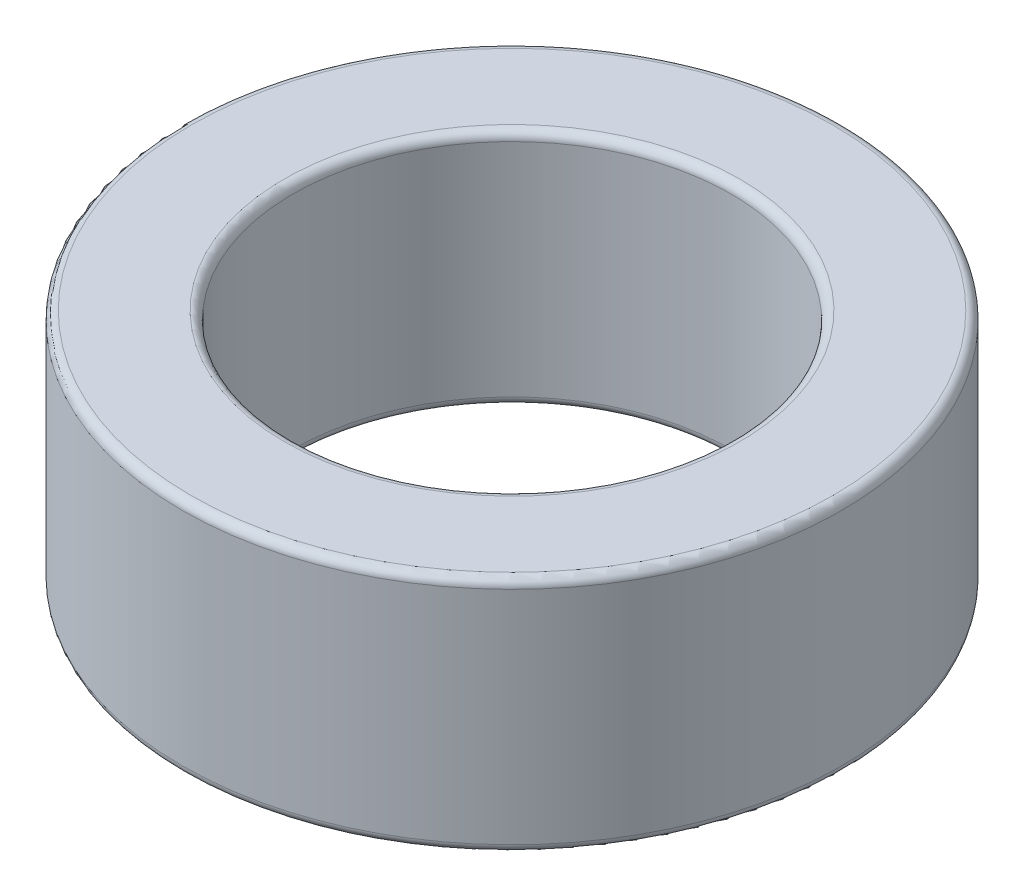
ISO-10303-21;
HEADER;
FILE_DESCRIPTION(('STEP AP214'),'2;1');
FILE_NAME('part.step','',(''),(''),'','','');
FILE_SCHEMA(('AUTOMOTIVE_DESIGN { 1 0 10303 214 1 1 1 1 }'));
ENDSEC;
DATA;
#1=APPLICATION_CONTEXT('core data for automotive mechanical design processes');
#2=APPLICATION_PROTOCOL_DEFINITION('international standard','automotive_design',2000,#1);
#3=PRODUCT_CONTEXT('',#1,'mechanical');
#4=PRODUCT('Part','Part','',(#3));
#5=PRODUCT_RELATED_PRODUCT_CATEGORY('part','',(#4));
#6=PRODUCT_DEFINITION_FORMATION('','',#4);
#7=PRODUCT_DEFINITION_CONTEXT('part definition',#1,'design');
#8=PRODUCT_DEFINITION('design','',#6,#7);
#9=PRODUCT_DEFINITION_SHAPE('','',#8);
#10=(LENGTH_UNIT() NAMED_UNIT(*) SI_UNIT(.MILLI.,.METRE.));
#11=(NAMED_UNIT(*) PLANE_ANGLE_UNIT() SI_UNIT($,.RADIAN.));
#12=(NAMED_UNIT(*) SI_UNIT($,.STERADIAN.) SOLID_ANGLE_UNIT());
#13=UNCERTAINTY_MEASURE_WITH_UNIT(LENGTH_MEASURE(1.E-05),#10,'distance_accuracy_value','');
#14=(GEOMETRIC_REPRESENTATION_CONTEXT(3) GLOBAL_UNCERTAINTY_ASSIGNED_CONTEXT((#13)) GLOBAL_UNIT_ASSIGNED_CONTEXT((#10,
#11,#12)) REPRESENTATION_CONTEXT('',''));
#15=CARTESIAN_POINT('',(0.,0.,0.));
#16=DIRECTION('',(0.,0.,1.));
#17=DIRECTION('',(1.,0.,0.));
#18=AXIS2_PLACEMENT_3D('',#15,#16,#17);
#19=CARTESIAN_POINT('',(0.,2.75,0.));
#20=DIRECTION('',(0.,1.,0.));
#21=DIRECTION('',(0.,0.,1.));
#22=AXIS2_PLACEMENT_3D('',#19,#20,#21);
#23=PLANE('',#22);
#24=CARTESIAN_POINT('',(0.,2.75,0.));
#25=DIRECTION('',(0.,1.,0.));
#26=DIRECTION('',(0.,0.,1.));
#27=AXIS2_PLACEMENT_3D('',#24,#25,#26);
#28=CIRCLE('',#27,2.625);
#29=CARTESIAN_POINT('',(0.,2.75,2.625));
#30=VERTEX_POINT('',#29);
#31=EDGE_CURVE('E10',#30,#30,#28,.F.);
#32=ORIENTED_EDGE('',*,*,#31,.T.);
#33=EDGE_LOOP('',(#32));
#34=FACE_BOUND('',#33,.T.);
#35=CARTESIAN_POINT('',(0.,2.75,0.));
#36=DIRECTION('',(0.,1.,0.));
#37=DIRECTION('',(0.,0.,1.));
#38=AXIS2_PLACEMENT_3D('',#35,#36,#37);
#39=CIRCLE('',#38,3.7);
#40=CARTESIAN_POINT('',(0.,2.75,3.7));
#41=VERTEX_POINT('',#40);
#42=EDGE_CURVE('E40',#41,#41,#39,.T.);
#43=ORIENTED_EDGE('',*,*,#42,.T.);
#44=EDGE_LOOP('',(#43));
#45=FACE_BOUND('',#44,.T.);
#46=ADVANCED_FACE('F33',(#34,#45),#23,.T.);
#47=CARTESIAN_POINT('',(0.,0.,0.));
#48=DIRECTION('',(0.,1.,0.));
#49=DIRECTION('',(0.,0.,1.));
#50=AXIS2_PLACEMENT_3D('',#47,#48,#49);
#51=PLANE('',#50);
#52=CARTESIAN_POINT('',(0.,0.,0.));
#53=DIRECTION('',(0.,1.,0.));
#54=DIRECTION('',(0.,0.,1.));
#55=AXIS2_PLACEMENT_3D('',#52,#53,#54);
#56=CIRCLE('',#55,2.625);
#57=CARTESIAN_POINT('',(0.,0.,2.625));
#58=VERTEX_POINT('',#57);
#59=EDGE_CURVE('E59',#58,#58,#56,.T.);
#60=ORIENTED_EDGE('',*,*,#59,.T.);
#61=EDGE_LOOP('',(#60));
#62=FACE_BOUND('',#61,.T.);
#63=CARTESIAN_POINT('',(0.,0.,0.));
#64=DIRECTION('',(0.,1.,0.));
#65=DIRECTION('',(0.,0.,1.));
#66=AXIS2_PLACEMENT_3D('',#63,#64,#65);
#67=CIRCLE('',#66,3.7);
#68=CARTESIAN_POINT('',(0.,0.,3.7));
#69=VERTEX_POINT('',#68);
#70=EDGE_CURVE('E62',#69,#69,#67,.F.);
#71=ORIENTED_EDGE('',*,*,#70,.T.);
#72=EDGE_LOOP('',(#71));
#73=FACE_BOUND('',#72,.T.);
#74=ADVANCED_FACE('F66',(#62,#73),#51,.F.);
#75=CARTESIAN_POINT('',(0.,2.75,0.));
#76=DIRECTION('',(0.,-1.,0.));
#77=DIRECTION('',(0.,0.,-1.));
#78=AXIS2_PLACEMENT_3D('',#75,#76,#77);
#79=CYLINDRICAL_SURFACE('',#78,3.8);
#80=CARTESIAN_POINT('',(0.,0.0999999999999998,0.));
#81=DIRECTION('',(0.,1.,0.));
#82=DIRECTION('',(0.,0.,1.));
#83=AXIS2_PLACEMENT_3D('',#80,#81,#82);
#84=CIRCLE('',#83,3.8);
#85=CARTESIAN_POINT('',(0.,0.0999999999999998,3.8));
#86=VERTEX_POINT('',#85);
#87=EDGE_CURVE('E44',#86,#86,#84,.T.);
#88=ORIENTED_EDGE('',*,*,#87,.T.);
#89=EDGE_LOOP('',(#88));
#90=FACE_BOUND('',#89,.T.);
#91=CARTESIAN_POINT('',(0.,2.65,0.));
#92=DIRECTION('',(0.,1.,0.));
#93=DIRECTION('',(0.,0.,1.));
#94=AXIS2_PLACEMENT_3D('',#91,#92,#93);
#95=CIRCLE('',#94,3.8);
#96=CARTESIAN_POINT('',(0.,2.65,3.8));
#97=VERTEX_POINT('',#96);
#98=EDGE_CURVE('E48',#97,#97,#95,.F.);
#99=ORIENTED_EDGE('',*,*,#98,.T.);
#100=EDGE_LOOP('',(#99));
#101=FACE_BOUND('',#100,.T.);
#102=ADVANCED_FACE('F76',(#90,#101),#79,.T.);
#103=CARTESIAN_POINT('',(0.,2.75,0.));
#104=DIRECTION('',(0.,-1.,0.));
#105=DIRECTION('',(0.,0.,-1.));
#106=AXIS2_PLACEMENT_3D('',#103,#104,#105);
#107=CYLINDRICAL_SURFACE('',#106,2.525);
#108=CARTESIAN_POINT('',(0.,0.0999999999999998,0.));
#109=DIRECTION('',(0.,1.,0.));
#110=DIRECTION('',(0.,0.,1.));
#111=AXIS2_PLACEMENT_3D('',#108,#109,#110);
#112=CIRCLE('',#111,2.525);
#113=CARTESIAN_POINT('',(0.,0.0999999999999998,2.525));
#114=VERTEX_POINT('',#113);
#115=EDGE_CURVE('E53',#114,#114,#112,.F.);
#116=ORIENTED_EDGE('',*,*,#115,.T.);
#117=EDGE_LOOP('',(#116));
#118=FACE_BOUND('',#117,.T.);
#119=CARTESIAN_POINT('',(0.,2.65,0.));
#120=DIRECTION('',(0.,1.,0.));
#121=DIRECTION('',(0.,0.,1.));
#122=AXIS2_PLACEMENT_3D('',#119,#120,#121);
#123=CIRCLE('',#122,2.525);
#124=CARTESIAN_POINT('',(0.,2.65,2.525));
#125=VERTEX_POINT('',#124);
#126=EDGE_CURVE('E56',#125,#125,#123,.T.);
#127=ORIENTED_EDGE('',*,*,#126,.T.);
#128=EDGE_LOOP('',(#127));
#129=FACE_BOUND('',#128,.T.);
#130=ADVANCED_FACE('F79',(#118,#129),#107,.F.);
#131=CARTESIAN_POINT('',(0.,0.0999999999999998,0.));
#132=DIRECTION('',(0.,1.,0.));
#133=DIRECTION('',(0.,0.,1.));
#134=AXIS2_PLACEMENT_3D('',#131,#132,#133);
#135=TOROIDAL_SURFACE('',#134,2.625,0.1);
#136=ORIENTED_EDGE('',*,*,#115,.F.);
#137=EDGE_LOOP('',(#136));
#138=FACE_BOUND('',#137,.T.);
#139=ORIENTED_EDGE('',*,*,#59,.F.);
#140=EDGE_LOOP('',(#139));
#141=FACE_BOUND('',#140,.T.);
#142=ADVANCED_FACE('F72',(#138,#141),#135,.T.);
#143=CARTESIAN_POINT('',(0.,0.0999999999999998,0.));
#144=DIRECTION('',(0.,1.,0.));
#145=DIRECTION('',(0.,0.,1.));
#146=AXIS2_PLACEMENT_3D('',#143,#144,#145);
#147=TOROIDAL_SURFACE('',#146,3.7,0.1);
#148=ORIENTED_EDGE('',*,*,#70,.F.);
#149=EDGE_LOOP('',(#148));
#150=FACE_BOUND('',#149,.T.);
#151=ORIENTED_EDGE('',*,*,#87,.F.);
#152=EDGE_LOOP('',(#151));
#153=FACE_BOUND('',#152,.T.);
#154=ADVANCED_FACE('F68',(#150,#153),#147,.T.);
#155=CARTESIAN_POINT('',(0.,2.65,0.));
#156=DIRECTION('',(0.,1.,0.));
#157=DIRECTION('',(0.,0.,1.));
#158=AXIS2_PLACEMENT_3D('',#155,#156,#157);
#159=TOROIDAL_SURFACE('',#158,2.625,0.1);
#160=ORIENTED_EDGE('',*,*,#31,.F.);
#161=EDGE_LOOP('',(#160));
#162=FACE_BOUND('',#161,.T.);
#163=ORIENTED_EDGE('',*,*,#126,.F.);
#164=EDGE_LOOP('',(#163));
#165=FACE_BOUND('',#164,.T.);
#166=ADVANCED_FACE('F71',(#162,#165),#159,.T.);
#167=CARTESIAN_POINT('',(0.,2.65,0.));
#168=DIRECTION('',(0.,1.,0.));
#169=DIRECTION('',(0.,0.,1.));
#170=AXIS2_PLACEMENT_3D('',#167,#168,#169);
#171=TOROIDAL_SURFACE('',#170,3.7,0.1);
#172=ORIENTED_EDGE('',*,*,#98,.F.);
#173=EDGE_LOOP('',(#172));
#174=FACE_BOUND('',#173,.T.);
#175=ORIENTED_EDGE('',*,*,#42,.F.);
#176=EDGE_LOOP('',(#175));
#177=FACE_BOUND('',#176,.T.);
#178=ADVANCED_FACE('F35',(#174,#177),#171,.T.);
#179=CLOSED_SHELL('',(#46,#74,#102,#130,#142,#154,#166,#178));
#180=MANIFOLD_SOLID_BREP('B2',#179);
#181=ADVANCED_BREP_SHAPE_REPRESENTATION('',(#18,#180),#14);
#182=SHAPE_DEFINITION_REPRESENTATION(#9,#181);
ENDSEC;
END-ISO-10303-21;
